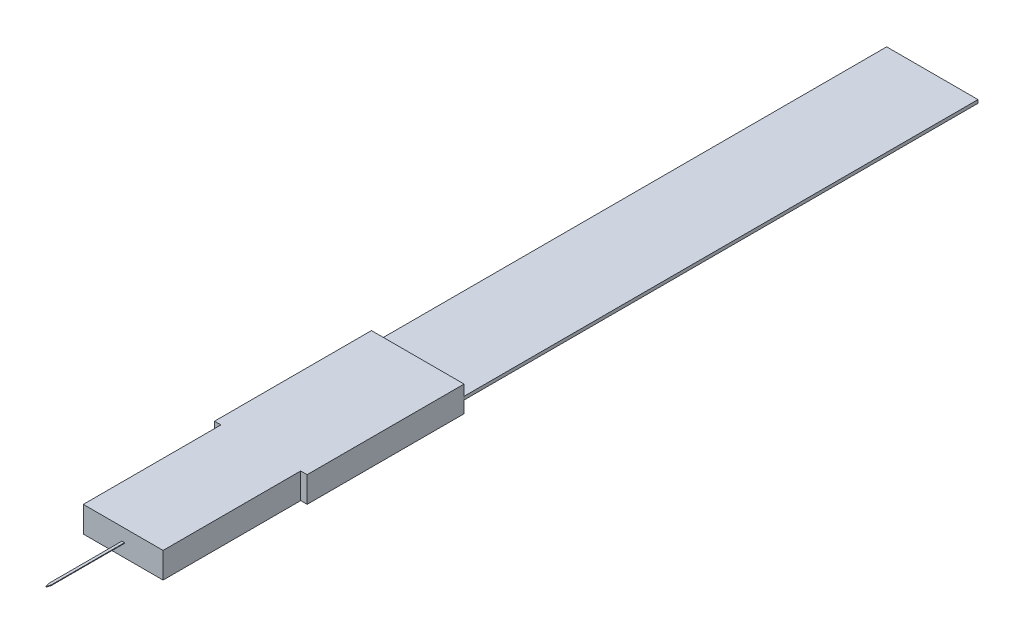
ISO-10303-21;
HEADER;
FILE_DESCRIPTION(('STEP AP214'),'2;1');
FILE_NAME('part.step','',(''),(''),'','','');
FILE_SCHEMA(('AUTOMOTIVE_DESIGN { 1 0 10303 214 1 1 1 1 }'));
ENDSEC;
DATA;
#1=APPLICATION_CONTEXT('core data for automotive mechanical design processes');
#2=APPLICATION_PROTOCOL_DEFINITION('international standard','automotive_design',2000,#1);
#3=PRODUCT_CONTEXT('',#1,'mechanical');
#4=PRODUCT('Part','Part','',(#3));
#5=PRODUCT_RELATED_PRODUCT_CATEGORY('part','',(#4));
#6=PRODUCT_DEFINITION_FORMATION('','',#4);
#7=PRODUCT_DEFINITION_CONTEXT('part definition',#1,'design');
#8=PRODUCT_DEFINITION('design','',#6,#7);
#9=PRODUCT_DEFINITION_SHAPE('','',#8);
#10=(LENGTH_UNIT() NAMED_UNIT(*) SI_UNIT(.MILLI.,.METRE.));
#11=(NAMED_UNIT(*) PLANE_ANGLE_UNIT() SI_UNIT($,.RADIAN.));
#12=(NAMED_UNIT(*) SI_UNIT($,.STERADIAN.) SOLID_ANGLE_UNIT());
#13=UNCERTAINTY_MEASURE_WITH_UNIT(LENGTH_MEASURE(1.E-05),#10,'distance_accuracy_value','');
#14=(GEOMETRIC_REPRESENTATION_CONTEXT(3) GLOBAL_UNCERTAINTY_ASSIGNED_CONTEXT((#13)) GLOBAL_UNIT_ASSIGNED_CONTEXT((#10,
#11,#12)) REPRESENTATION_CONTEXT('',''));
#15=CARTESIAN_POINT('',(0.,0.,0.));
#16=DIRECTION('',(0.,0.,1.));
#17=DIRECTION('',(1.,0.,0.));
#18=AXIS2_PLACEMENT_3D('',#15,#16,#17);
#19=CARTESIAN_POINT('',(0.,2.,16.8));
#20=DIRECTION('',(0.,0.,-1.));
#21=DIRECTION('',(-1.,0.,0.));
#22=AXIS2_PLACEMENT_3D('',#19,#20,#21);
#23=PLANE('',#22);
#24=DIRECTION('',(1.,0.,0.));
#25=VECTOR('',#24,1.);
#26=CARTESIAN_POINT('',(0.,0.,16.8));
#27=LINE('',#26,#25);
#28=CARTESIAN_POINT('',(-3.1,0.,16.8));
#29=VERTEX_POINT('',#28);
#30=CARTESIAN_POINT('',(3.1,0.,16.8));
#31=VERTEX_POINT('',#30);
#32=EDGE_CURVE('E236',#29,#31,#27,.T.);
#33=ORIENTED_EDGE('',*,*,#32,.T.);
#34=DIRECTION('',(0.,-1.,0.));
#35=VECTOR('',#34,1.);
#36=CARTESIAN_POINT('',(3.1,2.,16.8));
#37=LINE('',#36,#35);
#38=CARTESIAN_POINT('',(3.1,2.,16.8));
#39=VERTEX_POINT('',#38);
#40=EDGE_CURVE('E260',#39,#31,#37,.T.);
#41=ORIENTED_EDGE('',*,*,#40,.F.);
#42=DIRECTION('',(1.,0.,0.));
#43=VECTOR('',#42,1.);
#44=CARTESIAN_POINT('',(0.,2.,16.8));
#45=LINE('',#44,#43);
#46=CARTESIAN_POINT('',(-3.1,2.,16.8));
#47=VERTEX_POINT('',#46);
#48=EDGE_CURVE('E217',#47,#39,#45,.T.);
#49=ORIENTED_EDGE('',*,*,#48,.F.);
#50=DIRECTION('',(0.,-1.,0.));
#51=VECTOR('',#50,1.);
#52=CARTESIAN_POINT('',(-3.1,2.,16.8));
#53=LINE('',#52,#51);
#54=EDGE_CURVE('E44',#47,#29,#53,.T.);
#55=ORIENTED_EDGE('',*,*,#54,.T.);
#56=EDGE_LOOP('',(#33,#41,#49,#55));
#57=FACE_BOUND('',#56,.T.);
#58=DIRECTION('',(0.,1.,0.));
#59=VECTOR('',#58,1.);
#60=CARTESIAN_POINT('',(0.1,0.975,16.8));
#61=LINE('',#60,#59);
#62=CARTESIAN_POINT('',(0.1,0.975,16.8));
#63=VERTEX_POINT('',#62);
#64=CARTESIAN_POINT('',(0.1,1.025,16.8));
#65=VERTEX_POINT('',#64);
#66=EDGE_CURVE('E546',#63,#65,#61,.T.);
#67=ORIENTED_EDGE('',*,*,#66,.F.);
#68=DIRECTION('',(1.,0.,0.));
#69=VECTOR('',#68,1.);
#70=CARTESIAN_POINT('',(-0.1,0.975,16.8));
#71=LINE('',#70,#69);
#72=CARTESIAN_POINT('',(-0.1,0.975,16.8));
#73=VERTEX_POINT('',#72);
#74=EDGE_CURVE('E556',#73,#63,#71,.T.);
#75=ORIENTED_EDGE('',*,*,#74,.F.);
#76=DIRECTION('',(0.,-1.,0.));
#77=VECTOR('',#76,1.);
#78=CARTESIAN_POINT('',(-0.1,0.975,16.8));
#79=LINE('',#78,#77);
#80=CARTESIAN_POINT('',(-0.1,1.025,16.8));
#81=VERTEX_POINT('',#80);
#82=EDGE_CURVE('E554',#81,#73,#79,.T.);
#83=ORIENTED_EDGE('',*,*,#82,.F.);
#84=DIRECTION('',(-1.,0.,0.));
#85=VECTOR('',#84,1.);
#86=CARTESIAN_POINT('',(-0.1,1.025,16.8));
#87=LINE('',#86,#85);
#88=EDGE_CURVE('E173',#65,#81,#87,.T.);
#89=ORIENTED_EDGE('',*,*,#88,.F.);
#90=EDGE_LOOP('',(#67,#75,#83,#89));
#91=FACE_BOUND('',#90,.T.);
#92=ADVANCED_FACE('F36',(#57,#91),#23,.F.);
#93=CARTESIAN_POINT('',(0.,2.,-6.1));
#94=DIRECTION('',(0.,0.,-1.));
#95=DIRECTION('',(-1.,0.,0.));
#96=AXIS2_PLACEMENT_3D('',#93,#94,#95);
#97=PLANE('',#96);
#98=DIRECTION('',(1.,0.,0.));
#99=VECTOR('',#98,1.);
#100=CARTESIAN_POINT('',(0.,0.,-6.1));
#101=LINE('',#100,#99);
#102=CARTESIAN_POINT('',(-3.6,0.,-6.1));
#103=VERTEX_POINT('',#102);
#104=CARTESIAN_POINT('',(3.6,0.,-6.1));
#105=VERTEX_POINT('',#104);
#106=EDGE_CURVE('E245',#103,#105,#101,.T.);
#107=ORIENTED_EDGE('',*,*,#106,.F.);
#108=DIRECTION('',(0.,-1.,0.));
#109=VECTOR('',#108,1.);
#110=CARTESIAN_POINT('',(-3.6,2.,-6.1));
#111=LINE('',#110,#109);
#112=CARTESIAN_POINT('',(-3.6,2.,-6.1));
#113=VERTEX_POINT('',#112);
#114=EDGE_CURVE('E251',#113,#103,#111,.T.);
#115=ORIENTED_EDGE('',*,*,#114,.F.);
#116=DIRECTION('',(1.,0.,0.));
#117=VECTOR('',#116,1.);
#118=CARTESIAN_POINT('',(0.,2.,-6.1));
#119=LINE('',#118,#117);
#120=CARTESIAN_POINT('',(3.6,2.,-6.1));
#121=VERTEX_POINT('',#120);
#122=EDGE_CURVE('E224',#113,#121,#119,.T.);
#123=ORIENTED_EDGE('',*,*,#122,.T.);
#124=DIRECTION('',(0.,-1.,0.));
#125=VECTOR('',#124,1.);
#126=CARTESIAN_POINT('',(3.6,2.,-6.1));
#127=LINE('',#126,#125);
#128=EDGE_CURVE('E253',#121,#105,#127,.T.);
#129=ORIENTED_EDGE('',*,*,#128,.T.);
#130=EDGE_LOOP('',(#107,#115,#123,#129));
#131=FACE_BOUND('',#130,.T.);
#132=DIRECTION('',(1.,0.,0.));
#133=VECTOR('',#132,1.);
#134=CARTESIAN_POINT('',(3.55,1.1268423097839,-6.1));
#135=LINE('',#134,#133);
#136=CARTESIAN_POINT('',(-3.55,1.1268423097839,-6.1));
#137=VERTEX_POINT('',#136);
#138=CARTESIAN_POINT('',(3.55,1.1268423097839,-6.1));
#139=VERTEX_POINT('',#138);
#140=EDGE_CURVE('E194',#137,#139,#135,.T.);
#141=ORIENTED_EDGE('',*,*,#140,.F.);
#142=DIRECTION('',(0.,1.,0.));
#143=VECTOR('',#142,1.);
#144=CARTESIAN_POINT('',(-3.55,0.873157690216105,-6.1));
#145=LINE('',#144,#143);
#146=CARTESIAN_POINT('',(-3.55,0.873157690216105,-6.1));
#147=VERTEX_POINT('',#146);
#148=EDGE_CURVE('E175',#147,#137,#145,.T.);
#149=ORIENTED_EDGE('',*,*,#148,.F.);
#150=DIRECTION('',(-1.,0.,0.));
#151=VECTOR('',#150,1.);
#152=CARTESIAN_POINT('',(3.55,0.873157690216104,-6.1));
#153=LINE('',#152,#151);
#154=CARTESIAN_POINT('',(3.55,0.873157690216104,-6.1));
#155=VERTEX_POINT('',#154);
#156=EDGE_CURVE('E185',#155,#147,#153,.T.);
#157=ORIENTED_EDGE('',*,*,#156,.F.);
#158=DIRECTION('',(0.,-1.,0.));
#159=VECTOR('',#158,1.);
#160=CARTESIAN_POINT('',(3.55,0.873157690216104,-6.1));
#161=LINE('',#160,#159);
#162=EDGE_CURVE('E196',#139,#155,#161,.T.);
#163=ORIENTED_EDGE('',*,*,#162,.F.);
#164=EDGE_LOOP('',(#141,#149,#157,#163));
#165=FACE_BOUND('',#164,.T.);
#166=ADVANCED_FACE('F293',(#131,#165),#97,.T.);
#167=CARTESIAN_POINT('',(0.,2.,6.1));
#168=DIRECTION('',(0.,0.,-1.));
#169=DIRECTION('',(-1.,0.,0.));
#170=AXIS2_PLACEMENT_3D('',#167,#168,#169);
#171=PLANE('',#170);
#172=DIRECTION('',(1.,0.,0.));
#173=VECTOR('',#172,1.);
#174=CARTESIAN_POINT('',(0.,0.,6.1));
#175=LINE('',#174,#173);
#176=CARTESIAN_POINT('',(-3.6,0.,6.1));
#177=VERTEX_POINT('',#176);
#178=CARTESIAN_POINT('',(-3.1,0.,6.1));
#179=VERTEX_POINT('',#178);
#180=EDGE_CURVE('E209',#177,#179,#175,.T.);
#181=ORIENTED_EDGE('',*,*,#180,.T.);
#182=DIRECTION('',(0.,-1.,0.));
#183=VECTOR('',#182,1.);
#184=CARTESIAN_POINT('',(-3.1,2.,6.1));
#185=LINE('',#184,#183);
#186=CARTESIAN_POINT('',(-3.1,2.,6.1));
#187=VERTEX_POINT('',#186);
#188=EDGE_CURVE('E12',#187,#179,#185,.T.);
#189=ORIENTED_EDGE('',*,*,#188,.F.);
#190=DIRECTION('',(1.,0.,0.));
#191=VECTOR('',#190,1.);
#192=CARTESIAN_POINT('',(0.,2.,6.1));
#193=LINE('',#192,#191);
#194=CARTESIAN_POINT('',(-3.6,2.,6.1));
#195=VERTEX_POINT('',#194);
#196=EDGE_CURVE('E210',#195,#187,#193,.T.);
#197=ORIENTED_EDGE('',*,*,#196,.F.);
#198=DIRECTION('',(0.,-1.,0.));
#199=VECTOR('',#198,1.);
#200=CARTESIAN_POINT('',(-3.6,2.,6.1));
#201=LINE('',#200,#199);
#202=EDGE_CURVE('E230',#195,#177,#201,.T.);
#203=ORIENTED_EDGE('',*,*,#202,.T.);
#204=EDGE_LOOP('',(#181,#189,#197,#203));
#205=FACE_BOUND('',#204,.T.);
#206=ADVANCED_FACE('F286',(#205),#171,.F.);
#207=CARTESIAN_POINT('',(-3.1,2.,0.));
#208=DIRECTION('',(1.,0.,0.));
#209=DIRECTION('',(0.,0.,-1.));
#210=AXIS2_PLACEMENT_3D('',#207,#208,#209);
#211=PLANE('',#210);
#212=DIRECTION('',(0.,0.,1.));
#213=VECTOR('',#212,1.);
#214=CARTESIAN_POINT('',(-3.1,0.,0.));
#215=LINE('',#214,#213);
#216=EDGE_CURVE('E233',#179,#29,#215,.T.);
#217=ORIENTED_EDGE('',*,*,#216,.T.);
#218=ORIENTED_EDGE('',*,*,#54,.F.);
#219=DIRECTION('',(0.,0.,1.));
#220=VECTOR('',#219,1.);
#221=CARTESIAN_POINT('',(-3.1,2.,0.));
#222=LINE('',#221,#220);
#223=EDGE_CURVE('E213',#187,#47,#222,.T.);
#224=ORIENTED_EDGE('',*,*,#223,.F.);
#225=ORIENTED_EDGE('',*,*,#188,.T.);
#226=EDGE_LOOP('',(#217,#218,#224,#225));
#227=FACE_BOUND('',#226,.T.);
#228=ADVANCED_FACE('F38',(#227),#211,.F.);
#229=CARTESIAN_POINT('',(3.1,2.,0.));
#230=DIRECTION('',(1.,0.,0.));
#231=DIRECTION('',(0.,0.,-1.));
#232=AXIS2_PLACEMENT_3D('',#229,#230,#231);
#233=PLANE('',#232);
#234=DIRECTION('',(0.,0.,1.));
#235=VECTOR('',#234,1.);
#236=CARTESIAN_POINT('',(3.1,0.,0.));
#237=LINE('',#236,#235);
#238=CARTESIAN_POINT('',(3.1,0.,6.1));
#239=VERTEX_POINT('',#238);
#240=EDGE_CURVE('E239',#239,#31,#237,.T.);
#241=ORIENTED_EDGE('',*,*,#240,.F.);
#242=DIRECTION('',(0.,-1.,0.));
#243=VECTOR('',#242,1.);
#244=CARTESIAN_POINT('',(3.1,2.,6.1));
#245=LINE('',#244,#243);
#246=CARTESIAN_POINT('',(3.1,2.,6.1));
#247=VERTEX_POINT('',#246);
#248=EDGE_CURVE('E258',#247,#239,#245,.T.);
#249=ORIENTED_EDGE('',*,*,#248,.F.);
#250=DIRECTION('',(0.,0.,1.));
#251=VECTOR('',#250,1.);
#252=CARTESIAN_POINT('',(3.1,2.,0.));
#253=LINE('',#252,#251);
#254=EDGE_CURVE('E219',#247,#39,#253,.T.);
#255=ORIENTED_EDGE('',*,*,#254,.T.);
#256=ORIENTED_EDGE('',*,*,#40,.T.);
#257=EDGE_LOOP('',(#241,#249,#255,#256));
#258=FACE_BOUND('',#257,.T.);
#259=ADVANCED_FACE('F276',(#258),#233,.T.);
#260=CARTESIAN_POINT('',(3.6,0.,6.1));
#261=VERTEX_POINT('',#260);
#262=EDGE_CURVE('E234',#239,#261,#175,.T.);
#263=ORIENTED_EDGE('',*,*,#262,.T.);
#264=DIRECTION('',(0.,-1.,0.));
#265=VECTOR('',#264,1.);
#266=CARTESIAN_POINT('',(3.6,2.,6.1));
#267=LINE('',#266,#265);
#268=CARTESIAN_POINT('',(3.6,2.,6.1));
#269=VERTEX_POINT('',#268);
#270=EDGE_CURVE('E255',#269,#261,#267,.T.);
#271=ORIENTED_EDGE('',*,*,#270,.F.);
#272=EDGE_CURVE('E215',#247,#269,#193,.T.);
#273=ORIENTED_EDGE('',*,*,#272,.F.);
#274=ORIENTED_EDGE('',*,*,#248,.T.);
#275=EDGE_LOOP('',(#263,#271,#273,#274));
#276=FACE_BOUND('',#275,.T.);
#277=ADVANCED_FACE('F300',(#276),#171,.F.);
#278=CARTESIAN_POINT('',(3.6,2.,0.));
#279=DIRECTION('',(-1.,0.,0.));
#280=DIRECTION('',(0.,0.,1.));
#281=AXIS2_PLACEMENT_3D('',#278,#279,#280);
#282=PLANE('',#281);
#283=DIRECTION('',(0.,0.,-1.));
#284=VECTOR('',#283,1.);
#285=CARTESIAN_POINT('',(3.6,0.,0.));
#286=LINE('',#285,#284);
#287=EDGE_CURVE('E242',#261,#105,#286,.T.);
#288=ORIENTED_EDGE('',*,*,#287,.T.);
#289=ORIENTED_EDGE('',*,*,#128,.F.);
#290=DIRECTION('',(0.,0.,-1.));
#291=VECTOR('',#290,1.);
#292=CARTESIAN_POINT('',(3.6,2.,0.));
#293=LINE('',#292,#291);
#294=EDGE_CURVE('E222',#269,#121,#293,.T.);
#295=ORIENTED_EDGE('',*,*,#294,.F.);
#296=ORIENTED_EDGE('',*,*,#270,.T.);
#297=EDGE_LOOP('',(#288,#289,#295,#296));
#298=FACE_BOUND('',#297,.T.);
#299=ADVANCED_FACE('F297',(#298),#282,.F.);
#300=CARTESIAN_POINT('',(-3.6,2.,0.));
#301=DIRECTION('',(-1.,0.,0.));
#302=DIRECTION('',(0.,0.,1.));
#303=AXIS2_PLACEMENT_3D('',#300,#301,#302);
#304=PLANE('',#303);
#305=DIRECTION('',(0.,0.,-1.));
#306=VECTOR('',#305,1.);
#307=CARTESIAN_POINT('',(-3.6,0.,0.));
#308=LINE('',#307,#306);
#309=EDGE_CURVE('E214',#177,#103,#308,.T.);
#310=ORIENTED_EDGE('',*,*,#309,.F.);
#311=ORIENTED_EDGE('',*,*,#202,.F.);
#312=DIRECTION('',(0.,0.,-1.));
#313=VECTOR('',#312,1.);
#314=CARTESIAN_POINT('',(-3.6,2.,0.));
#315=LINE('',#314,#313);
#316=EDGE_CURVE('E227',#195,#113,#315,.T.);
#317=ORIENTED_EDGE('',*,*,#316,.T.);
#318=ORIENTED_EDGE('',*,*,#114,.T.);
#319=EDGE_LOOP('',(#310,#311,#317,#318));
#320=FACE_BOUND('',#319,.T.);
#321=ADVANCED_FACE('F289',(#320),#304,.T.);
#322=CARTESIAN_POINT('',(0.,2.,0.));
#323=DIRECTION('',(0.,1.,0.));
#324=DIRECTION('',(0.,0.,1.));
#325=AXIS2_PLACEMENT_3D('',#322,#323,#324);
#326=PLANE('',#325);
#327=ORIENTED_EDGE('',*,*,#196,.T.);
#328=ORIENTED_EDGE('',*,*,#223,.T.);
#329=ORIENTED_EDGE('',*,*,#48,.T.);
#330=ORIENTED_EDGE('',*,*,#254,.F.);
#331=ORIENTED_EDGE('',*,*,#272,.T.);
#332=ORIENTED_EDGE('',*,*,#294,.T.);
#333=ORIENTED_EDGE('',*,*,#122,.F.);
#334=ORIENTED_EDGE('',*,*,#316,.F.);
#335=EDGE_LOOP('',(#327,#328,#329,#330,#331,#332,#333,#334));
#336=FACE_BOUND('',#335,.T.);
#337=ADVANCED_FACE('F280',(#336),#326,.T.);
#338=CARTESIAN_POINT('',(0.,0.,0.));
#339=DIRECTION('',(0.,1.,0.));
#340=DIRECTION('',(0.,0.,1.));
#341=AXIS2_PLACEMENT_3D('',#338,#339,#340);
#342=PLANE('',#341);
#343=ORIENTED_EDGE('',*,*,#180,.F.);
#344=ORIENTED_EDGE('',*,*,#309,.T.);
#345=ORIENTED_EDGE('',*,*,#106,.T.);
#346=ORIENTED_EDGE('',*,*,#287,.F.);
#347=ORIENTED_EDGE('',*,*,#262,.F.);
#348=ORIENTED_EDGE('',*,*,#240,.T.);
#349=ORIENTED_EDGE('',*,*,#32,.F.);
#350=ORIENTED_EDGE('',*,*,#216,.F.);
#351=EDGE_LOOP('',(#343,#344,#345,#346,#347,#348,#349,#350));
#352=FACE_BOUND('',#351,.T.);
#353=ADVANCED_FACE('F271',(#352),#342,.F.);
#354=CARTESIAN_POINT('',(-3.55,0.873157690216105,-46.1));
#355=DIRECTION('',(1.,0.,0.));
#356=DIRECTION('',(0.,0.,-1.));
#357=AXIS2_PLACEMENT_3D('',#354,#355,#356);
#358=PLANE('',#357);
#359=ORIENTED_EDGE('',*,*,#148,.T.);
#360=DIRECTION('',(0.,0.,1.));
#361=VECTOR('',#360,1.);
#362=CARTESIAN_POINT('',(-3.55,1.1268423097839,-46.1));
#363=LINE('',#362,#361);
#364=CARTESIAN_POINT('',(-3.55,1.1268423097839,-46.1));
#365=VERTEX_POINT('',#364);
#366=EDGE_CURVE('E207',#365,#137,#363,.T.);
#367=ORIENTED_EDGE('',*,*,#366,.F.);
#368=DIRECTION('',(0.,1.,0.));
#369=VECTOR('',#368,1.);
#370=CARTESIAN_POINT('',(-3.55,0.873157690216105,-46.1));
#371=LINE('',#370,#369);
#372=CARTESIAN_POINT('',(-3.55,0.873157690216105,-46.1));
#373=VERTEX_POINT('',#372);
#374=EDGE_CURVE('E181',#373,#365,#371,.T.);
#375=ORIENTED_EDGE('',*,*,#374,.F.);
#376=DIRECTION('',(0.,0.,1.));
#377=VECTOR('',#376,1.);
#378=CARTESIAN_POINT('',(-3.55,0.873157690216105,-46.1));
#379=LINE('',#378,#377);
#380=EDGE_CURVE('E191',#373,#147,#379,.T.);
#381=ORIENTED_EDGE('',*,*,#380,.T.);
#382=EDGE_LOOP('',(#359,#367,#375,#381));
#383=FACE_BOUND('',#382,.T.);
#384=ADVANCED_FACE('F322',(#383),#358,.F.);
#385=CARTESIAN_POINT('',(3.55,1.1268423097839,-46.1));
#386=DIRECTION('',(0.,-1.,0.));
#387=DIRECTION('',(1.,0.,0.));
#388=AXIS2_PLACEMENT_3D('',#385,#386,#387);
#389=PLANE('',#388);
#390=ORIENTED_EDGE('',*,*,#140,.T.);
#391=DIRECTION('',(0.,0.,1.));
#392=VECTOR('',#391,1.);
#393=CARTESIAN_POINT('',(3.55,1.1268423097839,-46.1));
#394=LINE('',#393,#392);
#395=CARTESIAN_POINT('',(3.55,1.1268423097839,-46.1));
#396=VERTEX_POINT('',#395);
#397=EDGE_CURVE('E204',#396,#139,#394,.T.);
#398=ORIENTED_EDGE('',*,*,#397,.F.);
#399=DIRECTION('',(1.,0.,0.));
#400=VECTOR('',#399,1.);
#401=CARTESIAN_POINT('',(3.55,1.1268423097839,-46.1));
#402=LINE('',#401,#400);
#403=EDGE_CURVE('E184',#365,#396,#402,.T.);
#404=ORIENTED_EDGE('',*,*,#403,.F.);
#405=ORIENTED_EDGE('',*,*,#366,.T.);
#406=EDGE_LOOP('',(#390,#398,#404,#405));
#407=FACE_BOUND('',#406,.T.);
#408=ADVANCED_FACE('F327',(#407),#389,.F.);
#409=CARTESIAN_POINT('',(3.55,0.873157690216104,-46.1));
#410=DIRECTION('',(-1.,0.,0.));
#411=DIRECTION('',(0.,0.,1.));
#412=AXIS2_PLACEMENT_3D('',#409,#410,#411);
#413=PLANE('',#412);
#414=ORIENTED_EDGE('',*,*,#162,.T.);
#415=DIRECTION('',(0.,0.,1.));
#416=VECTOR('',#415,1.);
#417=CARTESIAN_POINT('',(3.55,0.873157690216104,-46.1));
#418=LINE('',#417,#416);
#419=CARTESIAN_POINT('',(3.55,0.873157690216104,-46.1));
#420=VERTEX_POINT('',#419);
#421=EDGE_CURVE('E202',#420,#155,#418,.T.);
#422=ORIENTED_EDGE('',*,*,#421,.F.);
#423=DIRECTION('',(0.,-1.,0.));
#424=VECTOR('',#423,1.);
#425=CARTESIAN_POINT('',(3.55,0.873157690216104,-46.1));
#426=LINE('',#425,#424);
#427=EDGE_CURVE('E187',#396,#420,#426,.T.);
#428=ORIENTED_EDGE('',*,*,#427,.F.);
#429=ORIENTED_EDGE('',*,*,#397,.T.);
#430=EDGE_LOOP('',(#414,#422,#428,#429));
#431=FACE_BOUND('',#430,.T.);
#432=ADVANCED_FACE('F331',(#431),#413,.F.);
#433=CARTESIAN_POINT('',(3.55,0.873157690216104,-46.1));
#434=DIRECTION('',(0.,1.,0.));
#435=DIRECTION('',(-1.,0.,0.));
#436=AXIS2_PLACEMENT_3D('',#433,#434,#435);
#437=PLANE('',#436);
#438=ORIENTED_EDGE('',*,*,#156,.T.);
#439=ORIENTED_EDGE('',*,*,#380,.F.);
#440=DIRECTION('',(-1.,0.,0.));
#441=VECTOR('',#440,1.);
#442=CARTESIAN_POINT('',(3.55,0.873157690216104,-46.1));
#443=LINE('',#442,#441);
#444=EDGE_CURVE('E189',#420,#373,#443,.T.);
#445=ORIENTED_EDGE('',*,*,#444,.F.);
#446=ORIENTED_EDGE('',*,*,#421,.T.);
#447=EDGE_LOOP('',(#438,#439,#445,#446));
#448=FACE_BOUND('',#447,.T.);
#449=ADVANCED_FACE('F335',(#448),#437,.F.);
#450=CARTESIAN_POINT('',(0.,0.,-46.1));
#451=DIRECTION('',(0.,0.,1.));
#452=DIRECTION('',(1.,0.,0.));
#453=AXIS2_PLACEMENT_3D('',#450,#451,#452);
#454=PLANE('',#453);
#455=ORIENTED_EDGE('',*,*,#374,.T.);
#456=ORIENTED_EDGE('',*,*,#403,.T.);
#457=ORIENTED_EDGE('',*,*,#427,.T.);
#458=ORIENTED_EDGE('',*,*,#444,.T.);
#459=EDGE_LOOP('',(#455,#456,#457,#458));
#460=FACE_BOUND('',#459,.T.);
#461=ADVANCED_FACE('F339',(#460),#454,.F.);
#462=CARTESIAN_POINT('',(0.1,0.975,22.8));
#463=DIRECTION('',(-1.,0.,0.));
#464=DIRECTION('',(0.,0.,1.));
#465=AXIS2_PLACEMENT_3D('',#462,#463,#464);
#466=PLANE('',#465);
#467=DIRECTION('',(0.,0.,-1.));
#468=VECTOR('',#467,1.);
#469=CARTESIAN_POINT('',(0.1,1.025,22.8));
#470=LINE('',#469,#468);
#471=CARTESIAN_POINT('',(0.0999999999999997,1.025,22.5));
#472=VERTEX_POINT('',#471);
#473=EDGE_CURVE('E51',#472,#65,#470,.T.);
#474=ORIENTED_EDGE('',*,*,#473,.F.);
#475=DIRECTION('',(0.,-1.,0.));
#476=VECTOR('',#475,1.);
#477=CARTESIAN_POINT('',(0.0999999999999997,1.34122776601684,22.5));
#478=LINE('',#477,#476);
#479=CARTESIAN_POINT('',(0.0999999999999997,0.975,22.5));
#480=VERTEX_POINT('',#479);
#481=EDGE_CURVE('E545',#472,#480,#478,.T.);
#482=ORIENTED_EDGE('',*,*,#481,.T.);
#483=DIRECTION('',(0.,0.,-1.));
#484=VECTOR('',#483,1.);
#485=CARTESIAN_POINT('',(0.1,0.975,22.8));
#486=LINE('',#485,#484);
#487=EDGE_CURVE('E177',#480,#63,#486,.T.);
#488=ORIENTED_EDGE('',*,*,#487,.T.);
#489=ORIENTED_EDGE('',*,*,#66,.T.);
#490=EDGE_LOOP('',(#474,#482,#488,#489));
#491=FACE_BOUND('',#490,.T.);
#492=ADVANCED_FACE('F343',(#491),#466,.F.);
#493=CARTESIAN_POINT('',(-0.1,1.025,22.8));
#494=DIRECTION('',(0.,-1.,0.));
#495=DIRECTION('',(0.,0.,-1.));
#496=AXIS2_PLACEMENT_3D('',#493,#494,#495);
#497=PLANE('',#496);
#498=DIRECTION('',(0.,0.,-1.));
#499=VECTOR('',#498,1.);
#500=CARTESIAN_POINT('',(-0.1,1.025,22.8));
#501=LINE('',#500,#499);
#502=CARTESIAN_POINT('',(-0.1,1.025,22.5));
#503=VERTEX_POINT('',#502);
#504=EDGE_CURVE('E59',#503,#81,#501,.T.);
#505=ORIENTED_EDGE('',*,*,#504,.F.);
#506=DIRECTION('',(-0.316227766016836,0.,-0.948683298050514));
#507=VECTOR('',#506,1.);
#508=CARTESIAN_POINT('',(-6.83999999999997,1.025,2.27999999999998));
#509=LINE('',#508,#507);
#510=CARTESIAN_POINT('',(0.,1.025,22.8));
#511=VERTEX_POINT('',#510);
#512=EDGE_CURVE('E158',#511,#503,#509,.T.);
#513=ORIENTED_EDGE('',*,*,#512,.F.);
#514=DIRECTION('',(-0.316227766016836,0.,0.948683298050514));
#515=VECTOR('',#514,1.);
#516=CARTESIAN_POINT('',(6.83999999999997,1.025,2.27999999999998));
#517=LINE('',#516,#515);
#518=EDGE_CURVE('E542',#472,#511,#517,.T.);
#519=ORIENTED_EDGE('',*,*,#518,.F.);
#520=ORIENTED_EDGE('',*,*,#473,.T.);
#521=ORIENTED_EDGE('',*,*,#88,.T.);
#522=EDGE_LOOP('',(#505,#513,#519,#520,#521));
#523=FACE_BOUND('',#522,.T.);
#524=ADVANCED_FACE('F172',(#523),#497,.F.);
#525=CARTESIAN_POINT('',(-0.1,0.975,22.8));
#526=DIRECTION('',(1.,0.,0.));
#527=DIRECTION('',(0.,0.,-1.));
#528=AXIS2_PLACEMENT_3D('',#525,#526,#527);
#529=PLANE('',#528);
#530=DIRECTION('',(0.,0.,-1.));
#531=VECTOR('',#530,1.);
#532=CARTESIAN_POINT('',(-0.1,0.975,22.8));
#533=LINE('',#532,#531);
#534=CARTESIAN_POINT('',(-0.0999999999999997,0.975,22.5));
#535=VERTEX_POINT('',#534);
#536=EDGE_CURVE('E170',#535,#73,#533,.T.);
#537=ORIENTED_EDGE('',*,*,#536,.F.);
#538=DIRECTION('',(0.,-1.,0.));
#539=VECTOR('',#538,1.);
#540=CARTESIAN_POINT('',(-0.0999999999999997,1.34122776601684,22.5));
#541=LINE('',#540,#539);
#542=EDGE_CURVE('E160',#503,#535,#541,.T.);
#543=ORIENTED_EDGE('',*,*,#542,.F.);
#544=ORIENTED_EDGE('',*,*,#504,.T.);
#545=ORIENTED_EDGE('',*,*,#82,.T.);
#546=EDGE_LOOP('',(#537,#543,#544,#545));
#547=FACE_BOUND('',#546,.T.);
#548=ADVANCED_FACE('F169',(#547),#529,.F.);
#549=CARTESIAN_POINT('',(-0.1,0.975,22.8));
#550=DIRECTION('',(0.,1.,0.));
#551=DIRECTION('',(0.,0.,1.));
#552=AXIS2_PLACEMENT_3D('',#549,#550,#551);
#553=PLANE('',#552);
#554=DIRECTION('',(0.316227766016836,0.,-0.948683298050514));
#555=VECTOR('',#554,1.);
#556=CARTESIAN_POINT('',(6.83999999999997,0.975,2.27999999999998));
#557=LINE('',#556,#555);
#558=CARTESIAN_POINT('',(0.,0.975,22.8));
#559=VERTEX_POINT('',#558);
#560=EDGE_CURVE('E165',#559,#480,#557,.T.);
#561=ORIENTED_EDGE('',*,*,#560,.F.);
#562=DIRECTION('',(0.316227766016836,0.,0.948683298050514));
#563=VECTOR('',#562,1.);
#564=CARTESIAN_POINT('',(-6.83999999999997,0.975,2.27999999999998));
#565=LINE('',#564,#563);
#566=EDGE_CURVE('E166',#535,#559,#565,.T.);
#567=ORIENTED_EDGE('',*,*,#566,.F.);
#568=ORIENTED_EDGE('',*,*,#536,.T.);
#569=ORIENTED_EDGE('',*,*,#74,.T.);
#570=ORIENTED_EDGE('',*,*,#487,.F.);
#571=EDGE_LOOP('',(#561,#567,#568,#569,#570));
#572=FACE_BOUND('',#571,.T.);
#573=ADVANCED_FACE('F352',(#572),#553,.F.);
#574=CARTESIAN_POINT('',(6.83999999999997,1.34122776601684,2.27999999999998));
#575=DIRECTION('',(-0.948683298050514,0.,-0.316227766016836));
#576=DIRECTION('',(-0.316227766016836,0.,0.948683298050514));
#577=AXIS2_PLACEMENT_3D('',#574,#575,#576);
#578=PLANE('',#577);
#579=ORIENTED_EDGE('',*,*,#518,.T.);
#580=DIRECTION('',(0.,-1.,0.));
#581=VECTOR('',#580,1.);
#582=CARTESIAN_POINT('',(0.,1.34122776601684,22.8));
#583=LINE('',#582,#581);
#584=EDGE_CURVE('E163',#511,#559,#583,.T.);
#585=ORIENTED_EDGE('',*,*,#584,.T.);
#586=ORIENTED_EDGE('',*,*,#560,.T.);
#587=ORIENTED_EDGE('',*,*,#481,.F.);
#588=EDGE_LOOP('',(#579,#585,#586,#587));
#589=FACE_BOUND('',#588,.T.);
#590=ADVANCED_FACE('F355',(#589),#578,.F.);
#591=CARTESIAN_POINT('',(-6.83999999999997,1.34122776601684,2.27999999999998));
#592=DIRECTION('',(0.948683298050514,0.,-0.316227766016836));
#593=DIRECTION('',(-0.316227766016836,0.,-0.948683298050514));
#594=AXIS2_PLACEMENT_3D('',#591,#592,#593);
#595=PLANE('',#594);
#596=ORIENTED_EDGE('',*,*,#512,.T.);
#597=ORIENTED_EDGE('',*,*,#542,.T.);
#598=ORIENTED_EDGE('',*,*,#566,.T.);
#599=ORIENTED_EDGE('',*,*,#584,.F.);
#600=EDGE_LOOP('',(#596,#597,#598,#599));
#601=FACE_BOUND('',#600,.T.);
#602=ADVANCED_FACE('F159',(#601),#595,.F.);
#603=CLOSED_SHELL('',(#92,#166,#206,#228,#259,#277,#299,#321,#337,#353,#384,#408,#432,#449,#461,
#492,#524,#548,#573,#590,#602));
#604=MANIFOLD_SOLID_BREP('B2',#603);
#605=ADVANCED_BREP_SHAPE_REPRESENTATION('',(#18,#604),#14);
#606=SHAPE_DEFINITION_REPRESENTATION(#9,#605);
ENDSEC;
END-ISO-10303-21;
